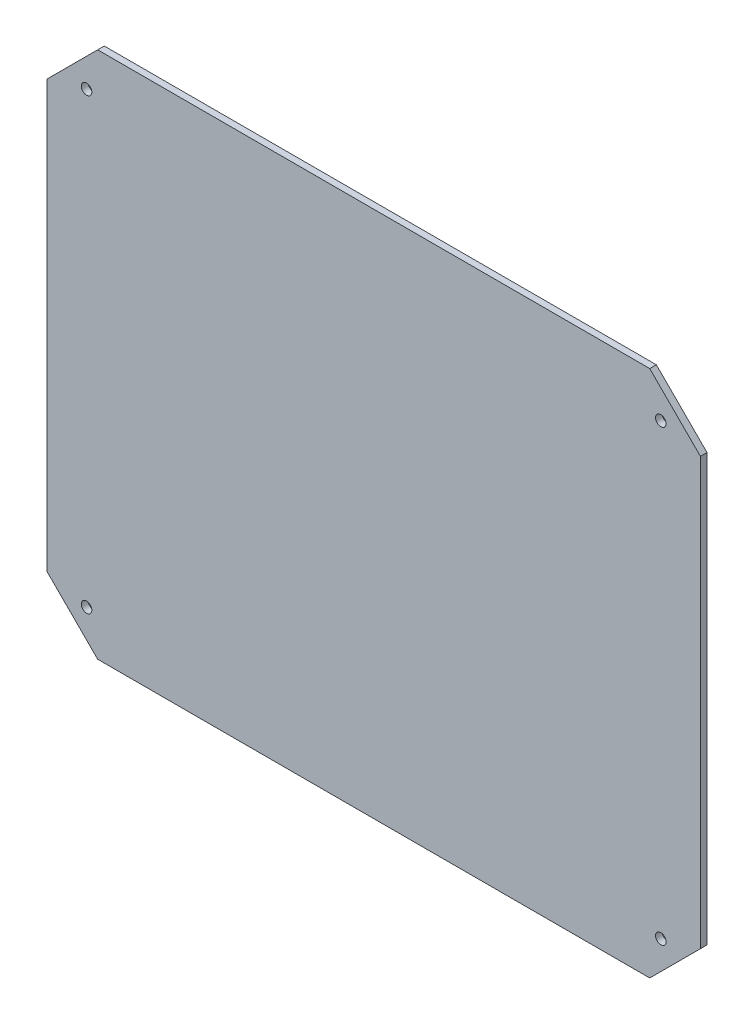
ISO-10303-21;
HEADER;
FILE_DESCRIPTION(('STEP AP214'),'2;1');
FILE_NAME('part.step','',(''),(''),'','','');
FILE_SCHEMA(('AUTOMOTIVE_DESIGN { 1 0 10303 214 1 1 1 1 }'));
ENDSEC;
DATA;
#1=APPLICATION_CONTEXT('core data for automotive mechanical design processes');
#2=APPLICATION_PROTOCOL_DEFINITION('international standard','automotive_design',2000,#1);
#3=PRODUCT_CONTEXT('',#1,'mechanical');
#4=PRODUCT('Part','Part','',(#3));
#5=PRODUCT_RELATED_PRODUCT_CATEGORY('part','',(#4));
#6=PRODUCT_DEFINITION_FORMATION('','',#4);
#7=PRODUCT_DEFINITION_CONTEXT('part definition',#1,'design');
#8=PRODUCT_DEFINITION('design','',#6,#7);
#9=PRODUCT_DEFINITION_SHAPE('','',#8);
#10=(LENGTH_UNIT() NAMED_UNIT(*) SI_UNIT(.MILLI.,.METRE.));
#11=(NAMED_UNIT(*) PLANE_ANGLE_UNIT() SI_UNIT($,.RADIAN.));
#12=(NAMED_UNIT(*) SI_UNIT($,.STERADIAN.) SOLID_ANGLE_UNIT());
#13=UNCERTAINTY_MEASURE_WITH_UNIT(LENGTH_MEASURE(1.E-05),#10,'distance_accuracy_value','');
#14=(GEOMETRIC_REPRESENTATION_CONTEXT(3) GLOBAL_UNCERTAINTY_ASSIGNED_CONTEXT((#13)) GLOBAL_UNIT_ASSIGNED_CONTEXT((#10,
#11,#12)) REPRESENTATION_CONTEXT('',''));
#15=CARTESIAN_POINT('',(0.,0.,0.));
#16=DIRECTION('',(0.,0.,1.));
#17=DIRECTION('',(1.,0.,0.));
#18=AXIS2_PLACEMENT_3D('',#15,#16,#17);
#19=CARTESIAN_POINT('',(0.,0.,2.));
#20=DIRECTION('',(0.,0.,1.));
#21=DIRECTION('',(1.,0.,0.));
#22=AXIS2_PLACEMENT_3D('',#19,#20,#21);
#23=PLANE('',#22);
#24=CARTESIAN_POINT('',(186.12,-12.,2.));
#25=DIRECTION('',(0.,0.,1.));
#26=DIRECTION('',(-1.,0.,0.));
#27=AXIS2_PLACEMENT_3D('',#24,#25,#26);
#28=CIRCLE('',#27,1.59999999999999);
#29=CARTESIAN_POINT('',(184.52,-12.,2.));
#30=VERTEX_POINT('',#29);
#31=EDGE_CURVE('E190',#30,#30,#28,.T.);
#32=ORIENTED_EDGE('',*,*,#31,.F.);
#33=EDGE_LOOP('',(#32));
#34=FACE_BOUND('',#33,.T.);
#35=CARTESIAN_POINT('',(12.,-148.02,2.));
#36=DIRECTION('',(0.,0.,1.));
#37=DIRECTION('',(-1.,0.,0.));
#38=AXIS2_PLACEMENT_3D('',#35,#36,#37);
#39=CIRCLE('',#38,1.6);
#40=CARTESIAN_POINT('',(10.4,-148.02,2.));
#41=VERTEX_POINT('',#40);
#42=EDGE_CURVE('E136',#41,#41,#39,.T.);
#43=ORIENTED_EDGE('',*,*,#42,.F.);
#44=EDGE_LOOP('',(#43));
#45=FACE_BOUND('',#44,.T.);
#46=DIRECTION('',(-1.,0.,0.));
#47=VECTOR('',#46,1.);
#48=CARTESIAN_POINT('',(182.753,0.,2.));
#49=LINE('',#48,#47);
#50=CARTESIAN_POINT('',(182.753,0.,2.));
#51=VERTEX_POINT('',#50);
#52=CARTESIAN_POINT('',(15.367,0.,2.));
#53=VERTEX_POINT('',#52);
#54=EDGE_CURVE('E147',#51,#53,#49,.T.);
#55=ORIENTED_EDGE('',*,*,#54,.T.);
#56=DIRECTION('',(-0.707106781186548,-0.707106781186547,0.));
#57=VECTOR('',#56,1.);
#58=CARTESIAN_POINT('',(15.367,0.,2.));
#59=LINE('',#58,#57);
#60=CARTESIAN_POINT('',(0.,-15.367,2.));
#61=VERTEX_POINT('',#60);
#62=EDGE_CURVE('E95',#53,#61,#59,.T.);
#63=ORIENTED_EDGE('',*,*,#62,.T.);
#64=DIRECTION('',(0.,-1.,0.));
#65=VECTOR('',#64,1.);
#66=CARTESIAN_POINT('',(0.,-15.367,2.));
#67=LINE('',#66,#65);
#68=CARTESIAN_POINT('',(0.,-144.653,2.));
#69=VERTEX_POINT('',#68);
#70=EDGE_CURVE('E162',#61,#69,#67,.T.);
#71=ORIENTED_EDGE('',*,*,#70,.T.);
#72=DIRECTION('',(0.707106781186547,-0.707106781186548,0.));
#73=VECTOR('',#72,1.);
#74=CARTESIAN_POINT('',(0.,-144.653,2.));
#75=LINE('',#74,#73);
#76=CARTESIAN_POINT('',(15.367,-160.02,2.));
#77=VERTEX_POINT('',#76);
#78=EDGE_CURVE('E175',#69,#77,#75,.T.);
#79=ORIENTED_EDGE('',*,*,#78,.T.);
#80=DIRECTION('',(1.,0.,0.));
#81=VECTOR('',#80,1.);
#82=CARTESIAN_POINT('',(15.367,-160.02,2.));
#83=LINE('',#82,#81);
#84=CARTESIAN_POINT('',(182.753,-160.02,2.));
#85=VERTEX_POINT('',#84);
#86=EDGE_CURVE('E114',#77,#85,#83,.T.);
#87=ORIENTED_EDGE('',*,*,#86,.T.);
#88=DIRECTION('',(0.707106781186548,0.707106781186547,0.));
#89=VECTOR('',#88,1.);
#90=CARTESIAN_POINT('',(182.753,-160.02,2.));
#91=LINE('',#90,#89);
#92=CARTESIAN_POINT('',(198.12,-144.653,2.));
#93=VERTEX_POINT('',#92);
#94=EDGE_CURVE('E108',#85,#93,#91,.T.);
#95=ORIENTED_EDGE('',*,*,#94,.T.);
#96=DIRECTION('',(0.,1.,0.));
#97=VECTOR('',#96,1.);
#98=CARTESIAN_POINT('',(198.12,-144.653,2.));
#99=LINE('',#98,#97);
#100=CARTESIAN_POINT('',(198.12,-15.367,2.));
#101=VERTEX_POINT('',#100);
#102=EDGE_CURVE('E112',#93,#101,#99,.T.);
#103=ORIENTED_EDGE('',*,*,#102,.T.);
#104=DIRECTION('',(-0.707106781186547,0.707106781186548,0.));
#105=VECTOR('',#104,1.);
#106=CARTESIAN_POINT('',(198.12,-15.367,2.));
#107=LINE('',#106,#105);
#108=EDGE_CURVE('E52',#101,#51,#107,.T.);
#109=ORIENTED_EDGE('',*,*,#108,.T.);
#110=EDGE_LOOP('',(#55,#63,#71,#79,#87,#95,#103,#109));
#111=FACE_BOUND('',#110,.T.);
#112=CARTESIAN_POINT('',(12.,-12.,2.));
#113=DIRECTION('',(0.,0.,1.));
#114=DIRECTION('',(1.,0.,0.));
#115=AXIS2_PLACEMENT_3D('',#112,#113,#114);
#116=CIRCLE('',#115,1.6);
#117=CARTESIAN_POINT('',(13.6,-12.,2.));
#118=VERTEX_POINT('',#117);
#119=EDGE_CURVE('E184',#118,#118,#116,.T.);
#120=ORIENTED_EDGE('',*,*,#119,.F.);
#121=EDGE_LOOP('',(#120));
#122=FACE_BOUND('',#121,.T.);
#123=CARTESIAN_POINT('',(186.12,-148.02,2.));
#124=DIRECTION('',(0.,0.,1.));
#125=DIRECTION('',(1.,0.,0.));
#126=AXIS2_PLACEMENT_3D('',#123,#124,#125);
#127=CIRCLE('',#126,1.59999999999999);
#128=CARTESIAN_POINT('',(187.72,-148.02,2.));
#129=VERTEX_POINT('',#128);
#130=EDGE_CURVE('E196',#129,#129,#127,.T.);
#131=ORIENTED_EDGE('',*,*,#130,.F.);
#132=EDGE_LOOP('',(#131));
#133=FACE_BOUND('',#132,.T.);
#134=ADVANCED_FACE('F35',(#34,#45,#111,#122,#133),#23,.T.);
#135=CARTESIAN_POINT('',(0.,0.,0.));
#136=DIRECTION('',(0.,0.,1.));
#137=DIRECTION('',(1.,0.,0.));
#138=AXIS2_PLACEMENT_3D('',#135,#136,#137);
#139=PLANE('',#138);
#140=DIRECTION('',(-1.,0.,0.));
#141=VECTOR('',#140,1.);
#142=CARTESIAN_POINT('',(182.753,0.,0.));
#143=LINE('',#142,#141);
#144=CARTESIAN_POINT('',(182.753,0.,0.));
#145=VERTEX_POINT('',#144);
#146=CARTESIAN_POINT('',(15.367,0.,0.));
#147=VERTEX_POINT('',#146);
#148=EDGE_CURVE('E132',#145,#147,#143,.T.);
#149=ORIENTED_EDGE('',*,*,#148,.F.);
#150=DIRECTION('',(-0.707106781186547,0.707106781186548,0.));
#151=VECTOR('',#150,1.);
#152=CARTESIAN_POINT('',(198.12,-15.367,0.));
#153=LINE('',#152,#151);
#154=CARTESIAN_POINT('',(198.12,-15.367,0.));
#155=VERTEX_POINT('',#154);
#156=EDGE_CURVE('E87',#155,#145,#153,.T.);
#157=ORIENTED_EDGE('',*,*,#156,.F.);
#158=DIRECTION('',(0.,1.,0.));
#159=VECTOR('',#158,1.);
#160=CARTESIAN_POINT('',(198.12,-144.653,0.));
#161=LINE('',#160,#159);
#162=CARTESIAN_POINT('',(198.12,-144.653,0.));
#163=VERTEX_POINT('',#162);
#164=EDGE_CURVE('E81',#163,#155,#161,.T.);
#165=ORIENTED_EDGE('',*,*,#164,.F.);
#166=DIRECTION('',(0.707106781186548,0.707106781186547,0.));
#167=VECTOR('',#166,1.);
#168=CARTESIAN_POINT('',(182.753,-160.02,0.));
#169=LINE('',#168,#167);
#170=CARTESIAN_POINT('',(182.753,-160.02,0.));
#171=VERTEX_POINT('',#170);
#172=EDGE_CURVE('E122',#171,#163,#169,.T.);
#173=ORIENTED_EDGE('',*,*,#172,.F.);
#174=DIRECTION('',(1.,0.,0.));
#175=VECTOR('',#174,1.);
#176=CARTESIAN_POINT('',(15.367,-160.02,0.));
#177=LINE('',#176,#175);
#178=CARTESIAN_POINT('',(15.367,-160.02,0.));
#179=VERTEX_POINT('',#178);
#180=EDGE_CURVE('E142',#179,#171,#177,.T.);
#181=ORIENTED_EDGE('',*,*,#180,.F.);
#182=DIRECTION('',(0.707106781186547,-0.707106781186548,0.));
#183=VECTOR('',#182,1.);
#184=CARTESIAN_POINT('',(0.,-144.653,0.));
#185=LINE('',#184,#183);
#186=CARTESIAN_POINT('',(0.,-144.653,0.));
#187=VERTEX_POINT('',#186);
#188=EDGE_CURVE('E140',#187,#179,#185,.T.);
#189=ORIENTED_EDGE('',*,*,#188,.F.);
#190=DIRECTION('',(0.,-1.,0.));
#191=VECTOR('',#190,1.);
#192=CARTESIAN_POINT('',(0.,-15.367,0.));
#193=LINE('',#192,#191);
#194=CARTESIAN_POINT('',(0.,-15.367,0.));
#195=VERTEX_POINT('',#194);
#196=EDGE_CURVE('E138',#195,#187,#193,.T.);
#197=ORIENTED_EDGE('',*,*,#196,.F.);
#198=DIRECTION('',(-0.707106781186548,-0.707106781186547,0.));
#199=VECTOR('',#198,1.);
#200=CARTESIAN_POINT('',(15.367,0.,0.));
#201=LINE('',#200,#199);
#202=EDGE_CURVE('E135',#147,#195,#201,.T.);
#203=ORIENTED_EDGE('',*,*,#202,.F.);
#204=EDGE_LOOP('',(#149,#157,#165,#173,#181,#189,#197,#203));
#205=FACE_BOUND('',#204,.T.);
#206=CARTESIAN_POINT('',(12.,-148.02,0.));
#207=DIRECTION('',(0.,0.,1.));
#208=DIRECTION('',(-1.,0.,0.));
#209=AXIS2_PLACEMENT_3D('',#206,#207,#208);
#210=CIRCLE('',#209,1.6);
#211=CARTESIAN_POINT('',(10.4,-148.02,0.));
#212=VERTEX_POINT('',#211);
#213=EDGE_CURVE('E181',#212,#212,#210,.T.);
#214=ORIENTED_EDGE('',*,*,#213,.T.);
#215=EDGE_LOOP('',(#214));
#216=FACE_BOUND('',#215,.T.);
#217=CARTESIAN_POINT('',(12.,-12.,0.));
#218=DIRECTION('',(0.,0.,1.));
#219=DIRECTION('',(1.,0.,0.));
#220=AXIS2_PLACEMENT_3D('',#217,#218,#219);
#221=CIRCLE('',#220,1.6);
#222=CARTESIAN_POINT('',(13.6,-12.,0.));
#223=VERTEX_POINT('',#222);
#224=EDGE_CURVE('E187',#223,#223,#221,.T.);
#225=ORIENTED_EDGE('',*,*,#224,.T.);
#226=EDGE_LOOP('',(#225));
#227=FACE_BOUND('',#226,.T.);
#228=CARTESIAN_POINT('',(186.12,-12.,0.));
#229=DIRECTION('',(0.,0.,1.));
#230=DIRECTION('',(-1.,0.,0.));
#231=AXIS2_PLACEMENT_3D('',#228,#229,#230);
#232=CIRCLE('',#231,1.59999999999999);
#233=CARTESIAN_POINT('',(184.52,-12.,0.));
#234=VERTEX_POINT('',#233);
#235=EDGE_CURVE('E193',#234,#234,#232,.T.);
#236=ORIENTED_EDGE('',*,*,#235,.T.);
#237=EDGE_LOOP('',(#236));
#238=FACE_BOUND('',#237,.T.);
#239=CARTESIAN_POINT('',(186.12,-148.02,0.));
#240=DIRECTION('',(0.,0.,1.));
#241=DIRECTION('',(1.,0.,0.));
#242=AXIS2_PLACEMENT_3D('',#239,#240,#241);
#243=CIRCLE('',#242,1.59999999999999);
#244=CARTESIAN_POINT('',(187.72,-148.02,0.));
#245=VERTEX_POINT('',#244);
#246=EDGE_CURVE('E199',#245,#245,#243,.T.);
#247=ORIENTED_EDGE('',*,*,#246,.T.);
#248=EDGE_LOOP('',(#247));
#249=FACE_BOUND('',#248,.T.);
#250=ADVANCED_FACE('F166',(#205,#216,#227,#238,#249),#139,.F.);
#251=CARTESIAN_POINT('',(182.753,0.,2.));
#252=DIRECTION('',(0.,-1.,0.));
#253=DIRECTION('',(1.,0.,0.));
#254=AXIS2_PLACEMENT_3D('',#251,#252,#253);
#255=PLANE('',#254);
#256=ORIENTED_EDGE('',*,*,#148,.T.);
#257=DIRECTION('',(0.,0.,-1.));
#258=VECTOR('',#257,1.);
#259=CARTESIAN_POINT('',(15.367,0.,2.));
#260=LINE('',#259,#258);
#261=EDGE_CURVE('E11',#53,#147,#260,.T.);
#262=ORIENTED_EDGE('',*,*,#261,.F.);
#263=ORIENTED_EDGE('',*,*,#54,.F.);
#264=DIRECTION('',(0.,0.,-1.));
#265=VECTOR('',#264,1.);
#266=CARTESIAN_POINT('',(182.753,0.,2.));
#267=LINE('',#266,#265);
#268=EDGE_CURVE('E128',#51,#145,#267,.T.);
#269=ORIENTED_EDGE('',*,*,#268,.T.);
#270=EDGE_LOOP('',(#256,#262,#263,#269));
#271=FACE_BOUND('',#270,.T.);
#272=ADVANCED_FACE('F37',(#271),#255,.F.);
#273=CARTESIAN_POINT('',(15.367,0.,2.));
#274=DIRECTION('',(0.707106781186547,-0.707106781186548,0.));
#275=DIRECTION('',(0.707106781186548,0.707106781186547,0.));
#276=AXIS2_PLACEMENT_3D('',#273,#274,#275);
#277=PLANE('',#276);
#278=ORIENTED_EDGE('',*,*,#202,.T.);
#279=DIRECTION('',(0.,0.,-1.));
#280=VECTOR('',#279,1.);
#281=CARTESIAN_POINT('',(0.,-15.367,2.));
#282=LINE('',#281,#280);
#283=EDGE_CURVE('E44',#61,#195,#282,.T.);
#284=ORIENTED_EDGE('',*,*,#283,.F.);
#285=ORIENTED_EDGE('',*,*,#62,.F.);
#286=ORIENTED_EDGE('',*,*,#261,.T.);
#287=EDGE_LOOP('',(#278,#284,#285,#286));
#288=FACE_BOUND('',#287,.T.);
#289=ADVANCED_FACE('F233',(#288),#277,.F.);
#290=CARTESIAN_POINT('',(0.,-15.367,2.));
#291=DIRECTION('',(1.,0.,0.));
#292=DIRECTION('',(0.,0.,-1.));
#293=AXIS2_PLACEMENT_3D('',#290,#291,#292);
#294=PLANE('',#293);
#295=ORIENTED_EDGE('',*,*,#196,.T.);
#296=DIRECTION('',(0.,0.,-1.));
#297=VECTOR('',#296,1.);
#298=CARTESIAN_POINT('',(0.,-144.653,2.));
#299=LINE('',#298,#297);
#300=EDGE_CURVE('E154',#69,#187,#299,.T.);
#301=ORIENTED_EDGE('',*,*,#300,.F.);
#302=ORIENTED_EDGE('',*,*,#70,.F.);
#303=ORIENTED_EDGE('',*,*,#283,.T.);
#304=EDGE_LOOP('',(#295,#301,#302,#303));
#305=FACE_BOUND('',#304,.T.);
#306=ADVANCED_FACE('F160',(#305),#294,.F.);
#307=CARTESIAN_POINT('',(0.,-144.653,2.));
#308=DIRECTION('',(0.707106781186548,0.707106781186547,0.));
#309=DIRECTION('',(-0.707106781186547,0.707106781186548,0.));
#310=AXIS2_PLACEMENT_3D('',#307,#308,#309);
#311=PLANE('',#310);
#312=ORIENTED_EDGE('',*,*,#188,.T.);
#313=DIRECTION('',(0.,0.,-1.));
#314=VECTOR('',#313,1.);
#315=CARTESIAN_POINT('',(15.367,-160.02,2.));
#316=LINE('',#315,#314);
#317=EDGE_CURVE('E151',#77,#179,#316,.T.);
#318=ORIENTED_EDGE('',*,*,#317,.F.);
#319=ORIENTED_EDGE('',*,*,#78,.F.);
#320=ORIENTED_EDGE('',*,*,#300,.T.);
#321=EDGE_LOOP('',(#312,#318,#319,#320));
#322=FACE_BOUND('',#321,.T.);
#323=ADVANCED_FACE('F171',(#322),#311,.F.);
#324=CARTESIAN_POINT('',(15.367,-160.02,2.));
#325=DIRECTION('',(0.,1.,0.));
#326=DIRECTION('',(-1.,0.,0.));
#327=AXIS2_PLACEMENT_3D('',#324,#325,#326);
#328=PLANE('',#327);
#329=ORIENTED_EDGE('',*,*,#180,.T.);
#330=DIRECTION('',(0.,0.,-1.));
#331=VECTOR('',#330,1.);
#332=CARTESIAN_POINT('',(182.753,-160.02,2.));
#333=LINE('',#332,#331);
#334=EDGE_CURVE('E123',#85,#171,#333,.T.);
#335=ORIENTED_EDGE('',*,*,#334,.F.);
#336=ORIENTED_EDGE('',*,*,#86,.F.);
#337=ORIENTED_EDGE('',*,*,#317,.T.);
#338=EDGE_LOOP('',(#329,#335,#336,#337));
#339=FACE_BOUND('',#338,.T.);
#340=ADVANCED_FACE('F174',(#339),#328,.F.);
#341=CARTESIAN_POINT('',(182.753,-160.02,2.));
#342=DIRECTION('',(-0.707106781186547,0.707106781186548,0.));
#343=DIRECTION('',(-0.707106781186548,-0.707106781186547,0.));
#344=AXIS2_PLACEMENT_3D('',#341,#342,#343);
#345=PLANE('',#344);
#346=ORIENTED_EDGE('',*,*,#172,.T.);
#347=DIRECTION('',(0.,0.,-1.));
#348=VECTOR('',#347,1.);
#349=CARTESIAN_POINT('',(198.12,-144.653,2.));
#350=LINE('',#349,#348);
#351=EDGE_CURVE('E119',#93,#163,#350,.T.);
#352=ORIENTED_EDGE('',*,*,#351,.F.);
#353=ORIENTED_EDGE('',*,*,#94,.F.);
#354=ORIENTED_EDGE('',*,*,#334,.T.);
#355=EDGE_LOOP('',(#346,#352,#353,#354));
#356=FACE_BOUND('',#355,.T.);
#357=ADVANCED_FACE('F120',(#356),#345,.F.);
#358=CARTESIAN_POINT('',(198.12,-144.653,2.));
#359=DIRECTION('',(-1.,0.,0.));
#360=DIRECTION('',(0.,0.,1.));
#361=AXIS2_PLACEMENT_3D('',#358,#359,#360);
#362=PLANE('',#361);
#363=ORIENTED_EDGE('',*,*,#164,.T.);
#364=DIRECTION('',(0.,0.,-1.));
#365=VECTOR('',#364,1.);
#366=CARTESIAN_POINT('',(198.12,-15.367,2.));
#367=LINE('',#366,#365);
#368=EDGE_CURVE('E124',#101,#155,#367,.T.);
#369=ORIENTED_EDGE('',*,*,#368,.F.);
#370=ORIENTED_EDGE('',*,*,#102,.F.);
#371=ORIENTED_EDGE('',*,*,#351,.T.);
#372=EDGE_LOOP('',(#363,#369,#370,#371));
#373=FACE_BOUND('',#372,.T.);
#374=ADVANCED_FACE('F126',(#373),#362,.F.);
#375=CARTESIAN_POINT('',(198.12,-15.367,2.));
#376=DIRECTION('',(-0.707106781186548,-0.707106781186547,0.));
#377=DIRECTION('',(0.707106781186547,-0.707106781186548,0.));
#378=AXIS2_PLACEMENT_3D('',#375,#376,#377);
#379=PLANE('',#378);
#380=ORIENTED_EDGE('',*,*,#156,.T.);
#381=ORIENTED_EDGE('',*,*,#268,.F.);
#382=ORIENTED_EDGE('',*,*,#108,.F.);
#383=ORIENTED_EDGE('',*,*,#368,.T.);
#384=EDGE_LOOP('',(#380,#381,#382,#383));
#385=FACE_BOUND('',#384,.T.);
#386=ADVANCED_FACE('F221',(#385),#379,.F.);
#387=CARTESIAN_POINT('',(12.,-148.02,2.));
#388=DIRECTION('',(0.,0.,-1.));
#389=DIRECTION('',(-1.,0.,0.));
#390=AXIS2_PLACEMENT_3D('',#387,#388,#389);
#391=CYLINDRICAL_SURFACE('',#390,1.6);
#392=ORIENTED_EDGE('',*,*,#42,.T.);
#393=EDGE_LOOP('',(#392));
#394=FACE_BOUND('',#393,.T.);
#395=ORIENTED_EDGE('',*,*,#213,.F.);
#396=EDGE_LOOP('',(#395));
#397=FACE_BOUND('',#396,.T.);
#398=ADVANCED_FACE('F218',(#394,#397),#391,.F.);
#399=CARTESIAN_POINT('',(12.,-12.,2.));
#400=DIRECTION('',(0.,0.,-1.));
#401=DIRECTION('',(-1.,0.,0.));
#402=AXIS2_PLACEMENT_3D('',#399,#400,#401);
#403=CYLINDRICAL_SURFACE('',#402,1.6);
#404=ORIENTED_EDGE('',*,*,#119,.T.);
#405=EDGE_LOOP('',(#404));
#406=FACE_BOUND('',#405,.T.);
#407=ORIENTED_EDGE('',*,*,#224,.F.);
#408=EDGE_LOOP('',(#407));
#409=FACE_BOUND('',#408,.T.);
#410=ADVANCED_FACE('F297',(#406,#409),#403,.F.);
#411=CARTESIAN_POINT('',(186.12,-12.,2.));
#412=DIRECTION('',(0.,0.,-1.));
#413=DIRECTION('',(-1.,0.,0.));
#414=AXIS2_PLACEMENT_3D('',#411,#412,#413);
#415=CYLINDRICAL_SURFACE('',#414,1.59999999999999);
#416=ORIENTED_EDGE('',*,*,#31,.T.);
#417=EDGE_LOOP('',(#416));
#418=FACE_BOUND('',#417,.T.);
#419=ORIENTED_EDGE('',*,*,#235,.F.);
#420=EDGE_LOOP('',(#419));
#421=FACE_BOUND('',#420,.T.);
#422=ADVANCED_FACE('F305',(#418,#421),#415,.F.);
#423=CARTESIAN_POINT('',(186.12,-148.02,2.));
#424=DIRECTION('',(0.,0.,-1.));
#425=DIRECTION('',(-1.,0.,0.));
#426=AXIS2_PLACEMENT_3D('',#423,#424,#425);
#427=CYLINDRICAL_SURFACE('',#426,1.59999999999999);
#428=ORIENTED_EDGE('',*,*,#130,.T.);
#429=EDGE_LOOP('',(#428));
#430=FACE_BOUND('',#429,.T.);
#431=ORIENTED_EDGE('',*,*,#246,.F.);
#432=EDGE_LOOP('',(#431));
#433=FACE_BOUND('',#432,.T.);
#434=ADVANCED_FACE('F205',(#430,#433),#427,.F.);
#435=CLOSED_SHELL('',(#134,#250,#272,#289,#306,#323,#340,#357,#374,#386,#398,#410,#422,#434));
#436=MANIFOLD_SOLID_BREP('B2',#435);
#437=ADVANCED_BREP_SHAPE_REPRESENTATION('',(#18,#436),#14);
#438=SHAPE_DEFINITION_REPRESENTATION(#9,#437);
ENDSEC;
END-ISO-10303-21;
